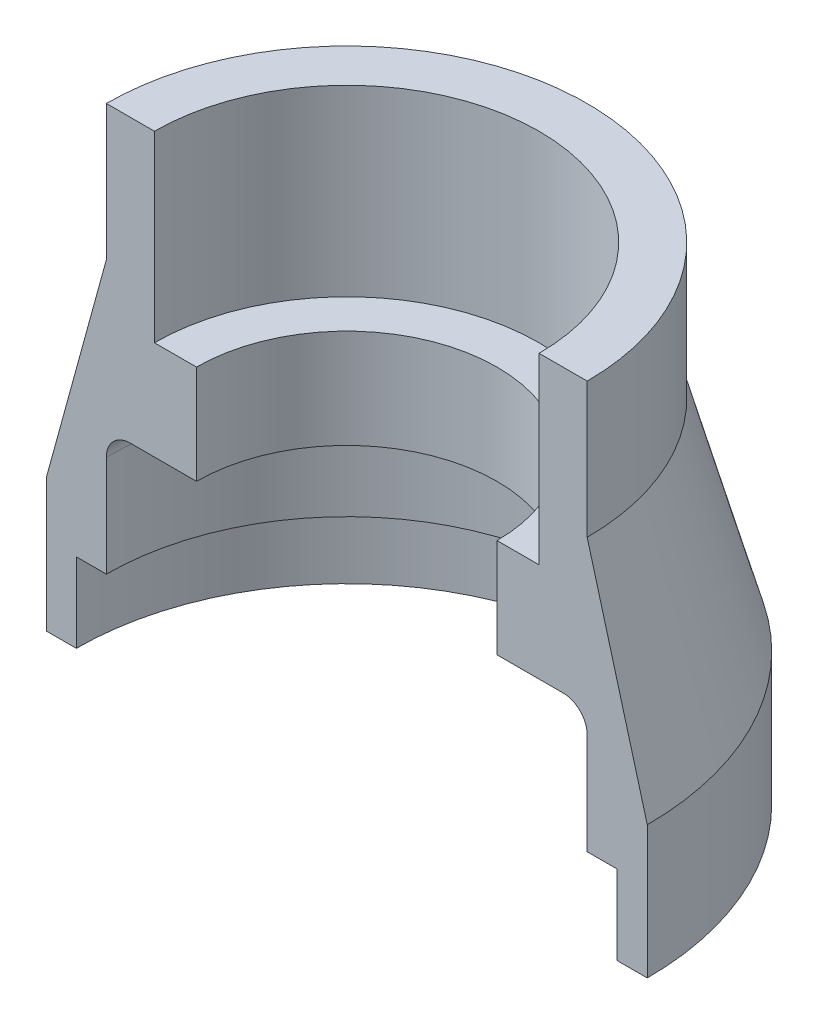
ISO-10303-21;
HEADER;
FILE_DESCRIPTION(('STEP AP214'),'2;1');
FILE_NAME('part.step','',(''),(''),'','','');
FILE_SCHEMA(('AUTOMOTIVE_DESIGN { 1 0 10303 214 1 1 1 1 }'));
ENDSEC;
DATA;
#1=APPLICATION_CONTEXT('core data for automotive mechanical design processes');
#2=APPLICATION_PROTOCOL_DEFINITION('international standard','automotive_design',2000,#1);
#3=PRODUCT_CONTEXT('',#1,'mechanical');
#4=PRODUCT('Part','Part','',(#3));
#5=PRODUCT_RELATED_PRODUCT_CATEGORY('part','',(#4));
#6=PRODUCT_DEFINITION_FORMATION('','',#4);
#7=PRODUCT_DEFINITION_CONTEXT('part definition',#1,'design');
#8=PRODUCT_DEFINITION('design','',#6,#7);
#9=PRODUCT_DEFINITION_SHAPE('','',#8);
#10=(LENGTH_UNIT() NAMED_UNIT(*) SI_UNIT(.MILLI.,.METRE.));
#11=(NAMED_UNIT(*) PLANE_ANGLE_UNIT() SI_UNIT($,.RADIAN.));
#12=(NAMED_UNIT(*) SI_UNIT($,.STERADIAN.) SOLID_ANGLE_UNIT());
#13=UNCERTAINTY_MEASURE_WITH_UNIT(LENGTH_MEASURE(1.E-05),#10,'distance_accuracy_value','');
#14=(GEOMETRIC_REPRESENTATION_CONTEXT(3) GLOBAL_UNCERTAINTY_ASSIGNED_CONTEXT((#13)) GLOBAL_UNIT_ASSIGNED_CONTEXT((#10,
#11,#12)) REPRESENTATION_CONTEXT('',''));
#15=CARTESIAN_POINT('',(0.,0.,0.));
#16=DIRECTION('',(0.,0.,1.));
#17=DIRECTION('',(1.,0.,0.));
#18=AXIS2_PLACEMENT_3D('',#15,#16,#17);
#19=CARTESIAN_POINT('',(20.,32.8495487885977,0.));
#20=DIRECTION('',(0.,-1.,0.));
#21=DIRECTION('',(0.,0.,-1.));
#22=AXIS2_PLACEMENT_3D('',#19,#20,#21);
#23=PLANE('',#22);
#24=CARTESIAN_POINT('',(0.,32.8495487885977,0.));
#25=DIRECTION('',(0.,1.,0.));
#26=DIRECTION('',(0.,0.,1.));
#27=AXIS2_PLACEMENT_3D('',#24,#25,#26);
#28=CIRCLE('',#27,20.);
#29=CARTESIAN_POINT('',(20.,32.8495487885977,0.));
#30=VERTEX_POINT('',#29);
#31=CARTESIAN_POINT('',(-20.,32.8495487885977,0.));
#32=VERTEX_POINT('',#31);
#33=EDGE_CURVE('E128',#30,#32,#28,.T.);
#34=ORIENTED_EDGE('',*,*,#33,.T.);
#35=DIRECTION('',(1.,0.,0.));
#36=VECTOR('',#35,1.);
#37=CARTESIAN_POINT('',(20.,32.8495487885977,0.));
#38=LINE('',#37,#36);
#39=CARTESIAN_POINT('',(-16.,32.8495487885977,0.));
#40=VERTEX_POINT('',#39);
#41=EDGE_CURVE('E143',#32,#40,#38,.T.);
#42=ORIENTED_EDGE('',*,*,#41,.T.);
#43=CARTESIAN_POINT('',(0.,32.8495487885977,0.));
#44=DIRECTION('',(0.,1.,0.));
#45=DIRECTION('',(0.,0.,1.));
#46=AXIS2_PLACEMENT_3D('',#43,#44,#45);
#47=CIRCLE('',#46,16.);
#48=CARTESIAN_POINT('',(16.,32.8495487885977,0.));
#49=VERTEX_POINT('',#48);
#50=EDGE_CURVE('E139',#49,#40,#47,.T.);
#51=ORIENTED_EDGE('',*,*,#50,.F.);
#52=EDGE_CURVE('E44',#49,#30,#38,.T.);
#53=ORIENTED_EDGE('',*,*,#52,.T.);
#54=EDGE_LOOP('',(#34,#42,#51,#53));
#55=FACE_BOUND('',#54,.T.);
#56=ADVANCED_FACE('F30',(#55),#23,.F.);
#57=CARTESIAN_POINT('',(0.,89.6373693858227,0.));
#58=DIRECTION('',(0.,1.,0.));
#59=DIRECTION('',(0.,0.,1.));
#60=AXIS2_PLACEMENT_3D('',#57,#58,#59);
#61=CYLINDRICAL_SURFACE('',#60,20.);
#62=CARTESIAN_POINT('',(0.,21.5950320702802,0.));
#63=DIRECTION('',(0.,1.,0.));
#64=DIRECTION('',(0.,0.,1.));
#65=AXIS2_PLACEMENT_3D('',#62,#63,#64);
#66=CIRCLE('',#65,20.);
#67=CARTESIAN_POINT('',(20.,21.5950320702802,0.));
#68=VERTEX_POINT('',#67);
#69=CARTESIAN_POINT('',(-20.,21.5950320702802,0.));
#70=VERTEX_POINT('',#69);
#71=EDGE_CURVE('E170',#68,#70,#66,.T.);
#72=ORIENTED_EDGE('',*,*,#71,.T.);
#73=DIRECTION('',(0.,1.,0.));
#74=VECTOR('',#73,1.);
#75=CARTESIAN_POINT('',(-20.,89.6373693858227,0.));
#76=LINE('',#75,#74);
#77=EDGE_CURVE('E183',#70,#32,#76,.T.);
#78=ORIENTED_EDGE('',*,*,#77,.T.);
#79=ORIENTED_EDGE('',*,*,#33,.F.);
#80=DIRECTION('',(0.,1.,0.));
#81=VECTOR('',#80,1.);
#82=CARTESIAN_POINT('',(20.,89.6373693858227,0.));
#83=LINE('',#82,#81);
#84=EDGE_CURVE('E181',#30,#68,#83,.F.);
#85=ORIENTED_EDGE('',*,*,#84,.T.);
#86=EDGE_LOOP('',(#72,#78,#79,#85));
#87=FACE_BOUND('',#86,.T.);
#88=ADVANCED_FACE('F180',(#87),#61,.T.);
#89=CARTESIAN_POINT('',(0.,3.38068223740579,0.));
#90=DIRECTION('',(0.,-1.,0.));
#91=DIRECTION('',(0.,0.,-1.));
#92=AXIS2_PLACEMENT_3D('',#89,#90,#91);
#93=CONICAL_SURFACE('',#92,25.,0.26790952380323);
#94=ORIENTED_EDGE('',*,*,#71,.F.);
#95=DIRECTION('',(0.264716115218194,-0.964326385796732,0.));
#96=VECTOR('',#95,1.);
#97=CARTESIAN_POINT('',(0.,94.4524314017778,0.));
#98=LINE('',#97,#96);
#99=CARTESIAN_POINT('',(25.,3.38068223740577,0.));
#100=VERTEX_POINT('',#99);
#101=EDGE_CURVE('E208',#68,#100,#98,.T.);
#102=ORIENTED_EDGE('',*,*,#101,.T.);
#103=CARTESIAN_POINT('',(0.,3.38068223740579,0.));
#104=DIRECTION('',(0.,1.,0.));
#105=DIRECTION('',(0.,0.,1.));
#106=AXIS2_PLACEMENT_3D('',#103,#104,#105);
#107=CIRCLE('',#106,25.);
#108=CARTESIAN_POINT('',(-25.,3.38068223740577,0.));
#109=VERTEX_POINT('',#108);
#110=EDGE_CURVE('E167',#100,#109,#107,.T.);
#111=ORIENTED_EDGE('',*,*,#110,.T.);
#112=DIRECTION('',(0.264716115218194,0.964326385796732,0.));
#113=VECTOR('',#112,1.);
#114=CARTESIAN_POINT('',(0.,94.4524314017778,0.));
#115=LINE('',#114,#113);
#116=EDGE_CURVE('E185',#109,#70,#115,.T.);
#117=ORIENTED_EDGE('',*,*,#116,.T.);
#118=EDGE_LOOP('',(#94,#102,#111,#117));
#119=FACE_BOUND('',#118,.T.);
#120=ADVANCED_FACE('F260',(#119),#93,.T.);
#121=CARTESIAN_POINT('',(0.,89.6373693858227,0.));
#122=DIRECTION('',(0.,1.,0.));
#123=DIRECTION('',(0.,0.,1.));
#124=AXIS2_PLACEMENT_3D('',#121,#122,#123);
#125=CYLINDRICAL_SURFACE('',#124,25.);
#126=CARTESIAN_POINT('',(0.,-7.65813411036356,0.));
#127=DIRECTION('',(0.,1.,0.));
#128=DIRECTION('',(0.,0.,1.));
#129=AXIS2_PLACEMENT_3D('',#126,#127,#128);
#130=CIRCLE('',#129,25.);
#131=CARTESIAN_POINT('',(25.,-7.65813411036356,0.));
#132=VERTEX_POINT('',#131);
#133=CARTESIAN_POINT('',(-25.,-7.65813411036356,0.));
#134=VERTEX_POINT('',#133);
#135=EDGE_CURVE('E164',#132,#134,#130,.T.);
#136=ORIENTED_EDGE('',*,*,#135,.T.);
#137=DIRECTION('',(0.,1.,0.));
#138=VECTOR('',#137,1.);
#139=CARTESIAN_POINT('',(-25.,89.6373693858227,0.));
#140=LINE('',#139,#138);
#141=EDGE_CURVE('E187',#134,#109,#140,.T.);
#142=ORIENTED_EDGE('',*,*,#141,.T.);
#143=ORIENTED_EDGE('',*,*,#110,.F.);
#144=DIRECTION('',(0.,1.,0.));
#145=VECTOR('',#144,1.);
#146=CARTESIAN_POINT('',(25.,89.6373693858227,0.));
#147=LINE('',#146,#145);
#148=EDGE_CURVE('E211',#100,#132,#147,.F.);
#149=ORIENTED_EDGE('',*,*,#148,.T.);
#150=EDGE_LOOP('',(#136,#142,#143,#149));
#151=FACE_BOUND('',#150,.T.);
#152=ADVANCED_FACE('F258',(#151),#125,.T.);
#153=CARTESIAN_POINT('',(22.5,-7.65813411036356,0.));
#154=DIRECTION('',(0.,1.,0.));
#155=DIRECTION('',(0.,0.,1.));
#156=AXIS2_PLACEMENT_3D('',#153,#154,#155);
#157=PLANE('',#156);
#158=ORIENTED_EDGE('',*,*,#135,.F.);
#159=DIRECTION('',(-1.,0.,0.));
#160=VECTOR('',#159,1.);
#161=CARTESIAN_POINT('',(22.5,-7.65813411036356,0.));
#162=LINE('',#161,#160);
#163=CARTESIAN_POINT('',(22.5,-7.65813411036355,0.));
#164=VERTEX_POINT('',#163);
#165=EDGE_CURVE('E214',#132,#164,#162,.T.);
#166=ORIENTED_EDGE('',*,*,#165,.T.);
#167=CARTESIAN_POINT('',(0.,-7.65813411036356,0.));
#168=DIRECTION('',(0.,1.,0.));
#169=DIRECTION('',(0.,0.,1.));
#170=AXIS2_PLACEMENT_3D('',#167,#168,#169);
#171=CIRCLE('',#170,22.5);
#172=CARTESIAN_POINT('',(-22.5,-7.65813411036355,0.));
#173=VERTEX_POINT('',#172);
#174=EDGE_CURVE('E161',#164,#173,#171,.T.);
#175=ORIENTED_EDGE('',*,*,#174,.T.);
#176=EDGE_CURVE('E192',#173,#134,#162,.T.);
#177=ORIENTED_EDGE('',*,*,#176,.T.);
#178=EDGE_LOOP('',(#158,#166,#175,#177));
#179=FACE_BOUND('',#178,.T.);
#180=ADVANCED_FACE('F255',(#179),#157,.F.);
#181=CARTESIAN_POINT('',(0.,89.6373693858227,0.));
#182=DIRECTION('',(0.,1.,0.));
#183=DIRECTION('',(0.,0.,1.));
#184=AXIS2_PLACEMENT_3D('',#181,#182,#183);
#185=CYLINDRICAL_SURFACE('',#184,22.5);
#186=CARTESIAN_POINT('',(0.,-1.0614262964751,0.));
#187=DIRECTION('',(0.,1.,0.));
#188=DIRECTION('',(0.,0.,1.));
#189=AXIS2_PLACEMENT_3D('',#186,#187,#188);
#190=CIRCLE('',#189,22.5);
#191=CARTESIAN_POINT('',(22.5,-1.06142629647509,0.));
#192=VERTEX_POINT('',#191);
#193=CARTESIAN_POINT('',(-22.5,-1.06142629647509,0.));
#194=VERTEX_POINT('',#193);
#195=EDGE_CURVE('E158',#192,#194,#190,.T.);
#196=ORIENTED_EDGE('',*,*,#195,.T.);
#197=DIRECTION('',(0.,1.,0.));
#198=VECTOR('',#197,1.);
#199=CARTESIAN_POINT('',(-22.5,89.6373693858227,0.));
#200=LINE('',#199,#198);
#201=EDGE_CURVE('E193',#194,#173,#200,.F.);
#202=ORIENTED_EDGE('',*,*,#201,.T.);
#203=ORIENTED_EDGE('',*,*,#174,.F.);
#204=DIRECTION('',(0.,1.,0.));
#205=VECTOR('',#204,1.);
#206=CARTESIAN_POINT('',(22.5,89.6373693858227,0.));
#207=LINE('',#206,#205);
#208=EDGE_CURVE('E217',#164,#192,#207,.T.);
#209=ORIENTED_EDGE('',*,*,#208,.T.);
#210=EDGE_LOOP('',(#196,#202,#203,#209));
#211=FACE_BOUND('',#210,.T.);
#212=ADVANCED_FACE('F251',(#211),#185,.F.);
#213=CARTESIAN_POINT('',(20.,-1.06142629647509,0.));
#214=DIRECTION('',(0.,1.,0.));
#215=DIRECTION('',(0.,0.,1.));
#216=AXIS2_PLACEMENT_3D('',#213,#214,#215);
#217=PLANE('',#216);
#218=ORIENTED_EDGE('',*,*,#195,.F.);
#219=DIRECTION('',(-1.,0.,0.));
#220=VECTOR('',#219,1.);
#221=CARTESIAN_POINT('',(20.,-1.06142629647509,0.));
#222=LINE('',#221,#220);
#223=CARTESIAN_POINT('',(20.,-1.06142629647508,0.));
#224=VERTEX_POINT('',#223);
#225=EDGE_CURVE('E220',#192,#224,#222,.T.);
#226=ORIENTED_EDGE('',*,*,#225,.T.);
#227=CARTESIAN_POINT('',(0.,-1.0614262964751,0.));
#228=DIRECTION('',(0.,1.,0.));
#229=DIRECTION('',(0.,0.,1.));
#230=AXIS2_PLACEMENT_3D('',#227,#228,#229);
#231=CIRCLE('',#230,20.);
#232=CARTESIAN_POINT('',(-20.,-1.06142629647508,0.));
#233=VERTEX_POINT('',#232);
#234=EDGE_CURVE('E155',#224,#233,#231,.T.);
#235=ORIENTED_EDGE('',*,*,#234,.T.);
#236=EDGE_CURVE('E196',#233,#194,#222,.T.);
#237=ORIENTED_EDGE('',*,*,#236,.T.);
#238=EDGE_LOOP('',(#218,#226,#235,#237));
#239=FACE_BOUND('',#238,.T.);
#240=ADVANCED_FACE('F248',(#239),#217,.F.);
#241=CARTESIAN_POINT('',(0.,89.6373693858227,0.));
#242=DIRECTION('',(0.,1.,0.));
#243=DIRECTION('',(0.,0.,1.));
#244=AXIS2_PLACEMENT_3D('',#241,#242,#243);
#245=CYLINDRICAL_SURFACE('',#244,20.);
#246=CARTESIAN_POINT('',(0.,7.37452792888936,0.));
#247=DIRECTION('',(0.,1.,0.));
#248=DIRECTION('',(0.,0.,1.));
#249=AXIS2_PLACEMENT_3D('',#246,#247,#248);
#250=CIRCLE('',#249,20.);
#251=CARTESIAN_POINT('',(20.,7.37452792888936,0.));
#252=VERTEX_POINT('',#251);
#253=CARTESIAN_POINT('',(-20.,7.37452792888936,0.));
#254=VERTEX_POINT('',#253);
#255=EDGE_CURVE('E152',#252,#254,#250,.T.);
#256=ORIENTED_EDGE('',*,*,#255,.T.);
#257=DIRECTION('',(0.,1.,0.));
#258=VECTOR('',#257,1.);
#259=CARTESIAN_POINT('',(-20.,89.6373693858227,0.));
#260=LINE('',#259,#258);
#261=EDGE_CURVE('E197',#254,#233,#260,.F.);
#262=ORIENTED_EDGE('',*,*,#261,.T.);
#263=ORIENTED_EDGE('',*,*,#234,.F.);
#264=DIRECTION('',(0.,1.,0.));
#265=VECTOR('',#264,1.);
#266=CARTESIAN_POINT('',(20.,89.6373693858227,0.));
#267=LINE('',#266,#265);
#268=EDGE_CURVE('E223',#224,#252,#267,.T.);
#269=ORIENTED_EDGE('',*,*,#268,.T.);
#270=EDGE_LOOP('',(#256,#262,#263,#269));
#271=FACE_BOUND('',#270,.T.);
#272=ADVANCED_FACE('F244',(#271),#245,.F.);
#273=CARTESIAN_POINT('',(0.,7.37452792888936,0.));
#274=DIRECTION('',(0.,1.,0.));
#275=DIRECTION('',(0.,0.,1.));
#276=AXIS2_PLACEMENT_3D('',#273,#274,#275);
#277=TOROIDAL_SURFACE('',#276,18.,2.);
#278=CARTESIAN_POINT('',(0.,9.37452792888936,0.));
#279=DIRECTION('',(0.,1.,0.));
#280=DIRECTION('',(0.,0.,1.));
#281=AXIS2_PLACEMENT_3D('',#278,#279,#280);
#282=CIRCLE('',#281,18.);
#283=CARTESIAN_POINT('',(18.,9.37452792888937,0.));
#284=VERTEX_POINT('',#283);
#285=CARTESIAN_POINT('',(-18.,9.37452792888937,0.));
#286=VERTEX_POINT('',#285);
#287=EDGE_CURVE('E149',#284,#286,#282,.T.);
#288=ORIENTED_EDGE('',*,*,#287,.T.);
#289=CARTESIAN_POINT('',(-18.,7.37452792888936,0.));
#290=DIRECTION('',(0.,0.,-1.));
#291=DIRECTION('',(-1.,0.,0.));
#292=AXIS2_PLACEMENT_3D('',#289,#290,#291);
#293=CIRCLE('',#292,2.);
#294=EDGE_CURVE('E200',#286,#254,#293,.F.);
#295=ORIENTED_EDGE('',*,*,#294,.T.);
#296=ORIENTED_EDGE('',*,*,#255,.F.);
#297=CARTESIAN_POINT('',(18.,7.37452792888936,0.));
#298=DIRECTION('',(0.,0.,-1.));
#299=DIRECTION('',(-1.,0.,0.));
#300=AXIS2_PLACEMENT_3D('',#297,#298,#299);
#301=CIRCLE('',#300,2.);
#302=EDGE_CURVE('E226',#252,#284,#301,.F.);
#303=ORIENTED_EDGE('',*,*,#302,.T.);
#304=EDGE_LOOP('',(#288,#295,#296,#303));
#305=FACE_BOUND('',#304,.T.);
#306=ADVANCED_FACE('F240',(#305),#277,.F.);
#307=CARTESIAN_POINT('',(12.5,9.37452792888937,0.));
#308=DIRECTION('',(0.,1.,0.));
#309=DIRECTION('',(0.,0.,1.));
#310=AXIS2_PLACEMENT_3D('',#307,#308,#309);
#311=PLANE('',#310);
#312=ORIENTED_EDGE('',*,*,#287,.F.);
#313=DIRECTION('',(-1.,0.,0.));
#314=VECTOR('',#313,1.);
#315=CARTESIAN_POINT('',(12.5,9.37452792888937,0.));
#316=LINE('',#315,#314);
#317=CARTESIAN_POINT('',(12.5,9.37452792888936,0.));
#318=VERTEX_POINT('',#317);
#319=EDGE_CURVE('E229',#284,#318,#316,.T.);
#320=ORIENTED_EDGE('',*,*,#319,.T.);
#321=CARTESIAN_POINT('',(0.,9.37452792888936,0.));
#322=DIRECTION('',(0.,1.,0.));
#323=DIRECTION('',(0.,0.,1.));
#324=AXIS2_PLACEMENT_3D('',#321,#322,#323);
#325=CIRCLE('',#324,12.5);
#326=CARTESIAN_POINT('',(-12.5,9.37452792888936,0.));
#327=VERTEX_POINT('',#326);
#328=EDGE_CURVE('E141',#318,#327,#325,.T.);
#329=ORIENTED_EDGE('',*,*,#328,.T.);
#330=EDGE_CURVE('E203',#327,#286,#316,.T.);
#331=ORIENTED_EDGE('',*,*,#330,.T.);
#332=EDGE_LOOP('',(#312,#320,#329,#331));
#333=FACE_BOUND('',#332,.T.);
#334=ADVANCED_FACE('F237',(#333),#311,.F.);
#335=CARTESIAN_POINT('',(0.,89.6373693858227,0.));
#336=DIRECTION('',(0.,1.,0.));
#337=DIRECTION('',(0.,0.,1.));
#338=AXIS2_PLACEMENT_3D('',#335,#336,#337);
#339=CYLINDRICAL_SURFACE('',#338,12.5);
#340=CARTESIAN_POINT('',(0.,17.6090573992094,0.));
#341=DIRECTION('',(0.,1.,0.));
#342=DIRECTION('',(0.,0.,1.));
#343=AXIS2_PLACEMENT_3D('',#340,#341,#342);
#344=CIRCLE('',#343,12.5);
#345=CARTESIAN_POINT('',(12.5,17.6090573992094,0.));
#346=VERTEX_POINT('',#345);
#347=CARTESIAN_POINT('',(-12.5,17.6090573992094,0.));
#348=VERTEX_POINT('',#347);
#349=EDGE_CURVE('E135',#346,#348,#344,.T.);
#350=ORIENTED_EDGE('',*,*,#349,.T.);
#351=DIRECTION('',(0.,1.,0.));
#352=VECTOR('',#351,1.);
#353=CARTESIAN_POINT('',(-12.5,89.6373693858227,0.));
#354=LINE('',#353,#352);
#355=EDGE_CURVE('E204',#348,#327,#354,.F.);
#356=ORIENTED_EDGE('',*,*,#355,.T.);
#357=ORIENTED_EDGE('',*,*,#328,.F.);
#358=DIRECTION('',(0.,1.,0.));
#359=VECTOR('',#358,1.);
#360=CARTESIAN_POINT('',(12.5,89.6373693858227,0.));
#361=LINE('',#360,#359);
#362=EDGE_CURVE('E136',#318,#346,#361,.T.);
#363=ORIENTED_EDGE('',*,*,#362,.T.);
#364=EDGE_LOOP('',(#350,#356,#357,#363));
#365=FACE_BOUND('',#364,.T.);
#366=ADVANCED_FACE('F234',(#365),#339,.F.);
#367=CARTESIAN_POINT('',(16.,17.6090573992094,0.));
#368=DIRECTION('',(0.,-1.,0.));
#369=DIRECTION('',(0.,0.,-1.));
#370=AXIS2_PLACEMENT_3D('',#367,#368,#369);
#371=PLANE('',#370);
#372=CARTESIAN_POINT('',(0.,17.6090573992094,0.));
#373=DIRECTION('',(0.,1.,0.));
#374=DIRECTION('',(0.,0.,1.));
#375=AXIS2_PLACEMENT_3D('',#372,#373,#374);
#376=CIRCLE('',#375,16.);
#377=CARTESIAN_POINT('',(16.,17.6090573992094,0.));
#378=VERTEX_POINT('',#377);
#379=CARTESIAN_POINT('',(-16.,17.6090573992094,0.));
#380=VERTEX_POINT('',#379);
#381=EDGE_CURVE('E133',#378,#380,#376,.T.);
#382=ORIENTED_EDGE('',*,*,#381,.T.);
#383=DIRECTION('',(1.,0.,0.));
#384=VECTOR('',#383,1.);
#385=CARTESIAN_POINT('',(16.,17.6090573992094,0.));
#386=LINE('',#385,#384);
#387=EDGE_CURVE('E52',#380,#348,#386,.T.);
#388=ORIENTED_EDGE('',*,*,#387,.T.);
#389=ORIENTED_EDGE('',*,*,#349,.F.);
#390=EDGE_CURVE('E122',#346,#378,#386,.T.);
#391=ORIENTED_EDGE('',*,*,#390,.T.);
#392=EDGE_LOOP('',(#382,#388,#389,#391));
#393=FACE_BOUND('',#392,.T.);
#394=ADVANCED_FACE('F132',(#393),#371,.F.);
#395=CARTESIAN_POINT('',(0.,89.6373693858227,0.));
#396=DIRECTION('',(0.,1.,0.));
#397=DIRECTION('',(0.,0.,1.));
#398=AXIS2_PLACEMENT_3D('',#395,#396,#397);
#399=CYLINDRICAL_SURFACE('',#398,16.);
#400=ORIENTED_EDGE('',*,*,#50,.T.);
#401=DIRECTION('',(0.,1.,0.));
#402=VECTOR('',#401,1.);
#403=CARTESIAN_POINT('',(-16.,89.6373693858227,0.));
#404=LINE('',#403,#402);
#405=EDGE_CURVE('E11',#40,#380,#404,.F.);
#406=ORIENTED_EDGE('',*,*,#405,.T.);
#407=ORIENTED_EDGE('',*,*,#381,.F.);
#408=DIRECTION('',(0.,1.,0.));
#409=VECTOR('',#408,1.);
#410=CARTESIAN_POINT('',(16.,89.6373693858227,0.));
#411=LINE('',#410,#409);
#412=EDGE_CURVE('E37',#378,#49,#411,.T.);
#413=ORIENTED_EDGE('',*,*,#412,.T.);
#414=EDGE_LOOP('',(#400,#406,#407,#413));
#415=FACE_BOUND('',#414,.T.);
#416=ADVANCED_FACE('F138',(#415),#399,.F.);
#417=CARTESIAN_POINT('',(-36.2106397751257,-100.,0.));
#418=DIRECTION('',(0.,0.,-1.));
#419=DIRECTION('',(-1.,0.,0.));
#420=AXIS2_PLACEMENT_3D('',#417,#418,#419);
#421=PLANE('',#420);
#422=ORIENTED_EDGE('',*,*,#412,.F.);
#423=ORIENTED_EDGE('',*,*,#390,.F.);
#424=ORIENTED_EDGE('',*,*,#362,.F.);
#425=ORIENTED_EDGE('',*,*,#319,.F.);
#426=ORIENTED_EDGE('',*,*,#302,.F.);
#427=ORIENTED_EDGE('',*,*,#268,.F.);
#428=ORIENTED_EDGE('',*,*,#225,.F.);
#429=ORIENTED_EDGE('',*,*,#208,.F.);
#430=ORIENTED_EDGE('',*,*,#165,.F.);
#431=ORIENTED_EDGE('',*,*,#148,.F.);
#432=ORIENTED_EDGE('',*,*,#101,.F.);
#433=ORIENTED_EDGE('',*,*,#84,.F.);
#434=ORIENTED_EDGE('',*,*,#52,.F.);
#435=EDGE_LOOP('',(#422,#423,#424,#425,#426,#427,#428,#429,#430,#431,#432,#433,#434));
#436=FACE_BOUND('',#435,.T.);
#437=ADVANCED_FACE('F121',(#436),#421,.F.);
#438=ORIENTED_EDGE('',*,*,#77,.F.);
#439=ORIENTED_EDGE('',*,*,#116,.F.);
#440=ORIENTED_EDGE('',*,*,#141,.F.);
#441=ORIENTED_EDGE('',*,*,#176,.F.);
#442=ORIENTED_EDGE('',*,*,#201,.F.);
#443=ORIENTED_EDGE('',*,*,#236,.F.);
#444=ORIENTED_EDGE('',*,*,#261,.F.);
#445=ORIENTED_EDGE('',*,*,#294,.F.);
#446=ORIENTED_EDGE('',*,*,#330,.F.);
#447=ORIENTED_EDGE('',*,*,#355,.F.);
#448=ORIENTED_EDGE('',*,*,#387,.F.);
#449=ORIENTED_EDGE('',*,*,#405,.F.);
#450=ORIENTED_EDGE('',*,*,#41,.F.);
#451=EDGE_LOOP('',(#438,#439,#440,#441,#442,#443,#444,#445,#446,#447,#448,#449,#450));
#452=FACE_BOUND('',#451,.T.);
#453=ADVANCED_FACE('F261',(#452),#421,.F.);
#454=CLOSED_SHELL('',(#56,#88,#120,#152,#180,#212,#240,#272,#306,#334,#366,#394,#416,#437,#453));
#455=MANIFOLD_SOLID_BREP('B2',#454);
#456=ADVANCED_BREP_SHAPE_REPRESENTATION('',(#18,#455),#14);
#457=SHAPE_DEFINITION_REPRESENTATION(#9,#456);
ENDSEC;
END-ISO-10303-21;
